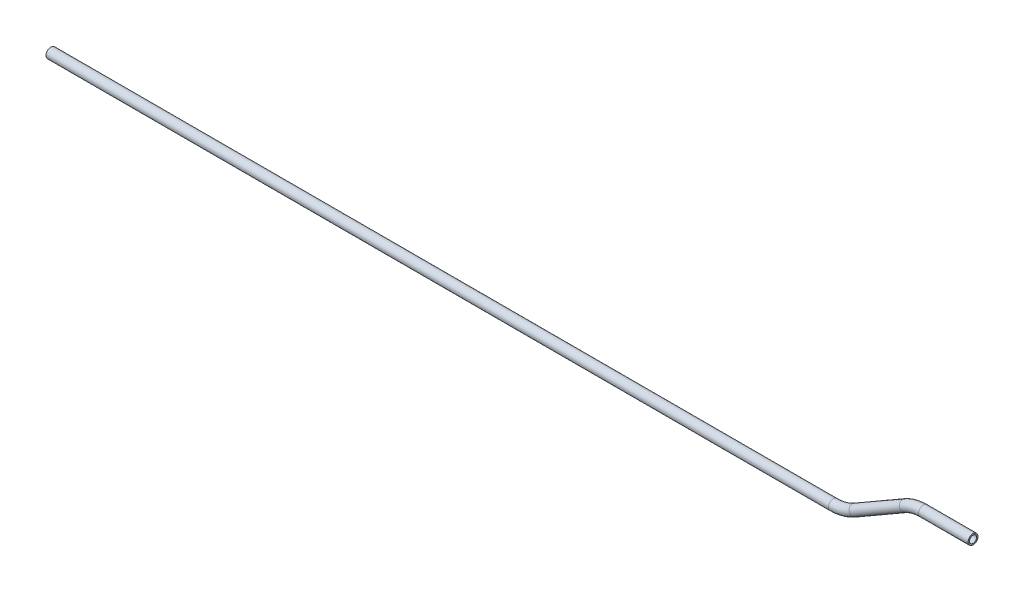
ISO-10303-21;
HEADER;
FILE_DESCRIPTION(('STEP AP214'),'2;1');
FILE_NAME('part.step','',(''),(''),'','','');
FILE_SCHEMA(('AUTOMOTIVE_DESIGN { 1 0 10303 214 1 1 1 1 }'));
ENDSEC;
DATA;
#1=APPLICATION_CONTEXT('core data for automotive mechanical design processes');
#2=APPLICATION_PROTOCOL_DEFINITION('international standard','automotive_design',2000,#1);
#3=PRODUCT_CONTEXT('',#1,'mechanical');
#4=PRODUCT('Part','Part','',(#3));
#5=PRODUCT_RELATED_PRODUCT_CATEGORY('part','',(#4));
#6=PRODUCT_DEFINITION_FORMATION('','',#4);
#7=PRODUCT_DEFINITION_CONTEXT('part definition',#1,'design');
#8=PRODUCT_DEFINITION('design','',#6,#7);
#9=PRODUCT_DEFINITION_SHAPE('','',#8);
#10=(LENGTH_UNIT() NAMED_UNIT(*) SI_UNIT(.MILLI.,.METRE.));
#11=(NAMED_UNIT(*) PLANE_ANGLE_UNIT() SI_UNIT($,.RADIAN.));
#12=(NAMED_UNIT(*) SI_UNIT($,.STERADIAN.) SOLID_ANGLE_UNIT());
#13=UNCERTAINTY_MEASURE_WITH_UNIT(LENGTH_MEASURE(1.E-05),#10,'distance_accuracy_value','');
#14=(GEOMETRIC_REPRESENTATION_CONTEXT(3) GLOBAL_UNCERTAINTY_ASSIGNED_CONTEXT((#13)) GLOBAL_UNIT_ASSIGNED_CONTEXT((#10,
#11,#12)) REPRESENTATION_CONTEXT('',''));
#15=CARTESIAN_POINT('',(0.,0.,0.));
#16=DIRECTION('',(0.,0.,1.));
#17=DIRECTION('',(1.,0.,0.));
#18=AXIS2_PLACEMENT_3D('',#15,#16,#17);
#19=CARTESIAN_POINT('',(-558.334087778049,-25.4000000000037,0.));
#20=DIRECTION('',(1.,0.,0.));
#21=DIRECTION('',(0.,1.,0.));
#22=AXIS2_PLACEMENT_3D('',#19,#20,#21);
#23=CYLINDRICAL_SURFACE('',#22,3.175);
#24=CARTESIAN_POINT('',(-57.672010970273,-25.4000000000001,0.));
#25=DIRECTION('',(1.,0.,0.));
#26=DIRECTION('',(0.,1.,0.));
#27=AXIS2_PLACEMENT_3D('',#24,#25,#26);
#28=CIRCLE('',#27,3.175);
#29=CARTESIAN_POINT('',(-57.672010970273,-28.5749999999999,0.));
#30=VERTEX_POINT('',#29);
#31=EDGE_CURVE('E65',#30,#30,#28,.T.);
#32=ORIENTED_EDGE('',*,*,#31,.F.);
#33=EDGE_LOOP('',(#32));
#34=FACE_BOUND('',#33,.T.);
#35=CARTESIAN_POINT('',(-558.334087778049,-25.4000000000037,0.));
#36=DIRECTION('',(1.,0.,0.));
#37=DIRECTION('',(0.,1.,0.));
#38=AXIS2_PLACEMENT_3D('',#35,#36,#37);
#39=CIRCLE('',#38,3.175);
#40=CARTESIAN_POINT('',(-558.334087778049,-22.2250000000037,0.));
#41=VERTEX_POINT('',#40);
#42=EDGE_CURVE('E61',#41,#41,#39,.T.);
#43=ORIENTED_EDGE('',*,*,#42,.T.);
#44=EDGE_LOOP('',(#43));
#45=FACE_BOUND('',#44,.T.);
#46=ADVANCED_FACE('F37',(#34,#45),#23,.T.);
#47=CARTESIAN_POINT('',(-57.672010970273,1.98550217542068,0.));
#48=DIRECTION('',(0.,0.,1.));
#49=DIRECTION('',(1.,0.,0.));
#50=AXIS2_PLACEMENT_3D('',#47,#48,#49);
#51=TOROIDAL_SURFACE('',#50,27.3855021754206,3.175);
#52=CARTESIAN_POINT('',(-43.9792598825628,-21.7310384038876,0.));
#53=DIRECTION('',(0.86602540378444,0.499999999999998,0.));
#54=DIRECTION('',(-0.499999999999998,0.86602540378444,0.));
#55=AXIS2_PLACEMENT_3D('',#52,#53,#54);
#56=CIRCLE('',#55,3.175);
#57=CARTESIAN_POINT('',(-42.3917598825628,-24.4806690609032,0.));
#58=VERTEX_POINT('',#57);
#59=EDGE_CURVE('E69',#58,#58,#56,.T.);
#60=CARTESIAN_POINT('',(-57.672010970273,1.98550217542068,0.));
#61=DIRECTION('',(0.,0.,1.));
#62=DIRECTION('',(1.,0.,0.));
#63=AXIS2_PLACEMENT_3D('',#60,#61,#62);
#64=CIRCLE('',#63,30.5605021754206);
#65=EDGE_CURVE('',#30,#58,#64,.T.);
#66=ORIENTED_EDGE('',*,*,#31,.T.);
#67=ORIENTED_EDGE('',*,*,#59,.F.);
#68=ORIENTED_EDGE('',*,*,#65,.T.);
#69=ORIENTED_EDGE('',*,*,#65,.F.);
#70=EDGE_LOOP('',(#66,#68,#67,#69));
#71=FACE_BOUND('',#70,.T.);
#72=ADVANCED_FACE('F91',(#71),#51,.T.);
#73=CARTESIAN_POINT('',(-43.9792598825628,-21.7310384038875,0.));
#74=DIRECTION('',(0.866025403784437,0.500000000000003,0.));
#75=DIRECTION('',(-0.500000000000003,0.866025403784437,0.));
#76=AXIS2_PLACEMENT_3D('',#73,#74,#75);
#77=CYLINDRICAL_SURFACE('',#76,3.175);
#78=CARTESIAN_POINT('',(-11.8305959579056,-3.16999863289972,0.));
#79=DIRECTION('',(0.866025403784437,0.500000000000003,0.));
#80=DIRECTION('',(-0.500000000000003,0.866025403784437,0.));
#81=AXIS2_PLACEMENT_3D('',#78,#79,#80);
#82=CIRCLE('',#81,3.175);
#83=CARTESIAN_POINT('',(-13.4180959579056,-0.420367975884135,0.));
#84=VERTEX_POINT('',#83);
#85=EDGE_CURVE('E72',#84,#84,#82,.T.);
#86=ORIENTED_EDGE('',*,*,#85,.F.);
#87=EDGE_LOOP('',(#86));
#88=FACE_BOUND('',#87,.T.);
#89=ORIENTED_EDGE('',*,*,#59,.T.);
#90=EDGE_LOOP('',(#89));
#91=FACE_BOUND('',#90,.T.);
#92=ADVANCED_FACE('F84',(#88,#91),#77,.T.);
#93=CARTESIAN_POINT('',(0.,-23.661191915811,0.));
#94=DIRECTION('',(0.,0.,-1.));
#95=DIRECTION('',(-1.,0.,0.));
#96=AXIS2_PLACEMENT_3D('',#93,#94,#95);
#97=TOROIDAL_SURFACE('',#96,23.661191915811,3.175);
#98=CARTESIAN_POINT('',(0.,0.,0.));
#99=DIRECTION('',(1.,0.,0.));
#100=DIRECTION('',(0.,1.,0.));
#101=AXIS2_PLACEMENT_3D('',#98,#99,#100);
#102=CIRCLE('',#101,3.175);
#103=CARTESIAN_POINT('',(0.,3.175,0.));
#104=VERTEX_POINT('',#103);
#105=EDGE_CURVE('E41',#104,#104,#102,.T.);
#106=CARTESIAN_POINT('',(0.,-23.661191915811,0.));
#107=DIRECTION('',(0.,0.,-1.));
#108=DIRECTION('',(-1.,0.,0.));
#109=AXIS2_PLACEMENT_3D('',#106,#107,#108);
#110=CIRCLE('',#109,26.836191915811);
#111=EDGE_CURVE('',#84,#104,#110,.T.);
#112=ORIENTED_EDGE('',*,*,#85,.T.);
#113=ORIENTED_EDGE('',*,*,#105,.F.);
#114=ORIENTED_EDGE('',*,*,#111,.T.);
#115=ORIENTED_EDGE('',*,*,#111,.F.);
#116=EDGE_LOOP('',(#112,#114,#113,#115));
#117=FACE_BOUND('',#116,.T.);
#118=ADVANCED_FACE('F82',(#117),#97,.T.);
#119=CARTESIAN_POINT('',(0.,0.,0.));
#120=DIRECTION('',(1.,0.,0.));
#121=DIRECTION('',(0.,1.,0.));
#122=AXIS2_PLACEMENT_3D('',#119,#120,#121);
#123=CYLINDRICAL_SURFACE('',#122,3.175);
#124=CARTESIAN_POINT('',(31.7600027342006,0.,0.));
#125=DIRECTION('',(1.,0.,0.));
#126=DIRECTION('',(0.,1.,0.));
#127=AXIS2_PLACEMENT_3D('',#124,#125,#126);
#128=CIRCLE('',#127,3.175);
#129=CARTESIAN_POINT('',(31.7600027342006,3.175,0.));
#130=VERTEX_POINT('',#129);
#131=EDGE_CURVE('E56',#130,#130,#128,.T.);
#132=ORIENTED_EDGE('',*,*,#131,.F.);
#133=EDGE_LOOP('',(#132));
#134=FACE_BOUND('',#133,.T.);
#135=ORIENTED_EDGE('',*,*,#105,.T.);
#136=EDGE_LOOP('',(#135));
#137=FACE_BOUND('',#136,.T.);
#138=ADVANCED_FACE('F39',(#134,#137),#123,.T.);
#139=CARTESIAN_POINT('',(-558.334087778049,-25.4000000000037,0.));
#140=DIRECTION('',(1.,0.,0.));
#141=DIRECTION('',(0.,1.,0.));
#142=AXIS2_PLACEMENT_3D('',#139,#140,#141);
#143=PLANE('',#142);
#144=CARTESIAN_POINT('',(-558.334087778049,-25.4000000000037,0.));
#145=DIRECTION('',(1.,0.,0.));
#146=DIRECTION('',(0.,1.,0.));
#147=AXIS2_PLACEMENT_3D('',#144,#145,#146);
#148=CIRCLE('',#147,2.286);
#149=CARTESIAN_POINT('',(-558.334087778049,-23.1140000000037,0.));
#150=VERTEX_POINT('',#149);
#151=EDGE_CURVE('E60',#150,#150,#148,.F.);
#152=ORIENTED_EDGE('',*,*,#151,.F.);
#153=EDGE_LOOP('',(#152));
#154=FACE_BOUND('',#153,.T.);
#155=ORIENTED_EDGE('',*,*,#42,.F.);
#156=EDGE_LOOP('',(#155));
#157=FACE_BOUND('',#156,.T.);
#158=ADVANCED_FACE('F89',(#154,#157),#143,.F.);
#159=CARTESIAN_POINT('',(31.7600027342006,0.,0.));
#160=DIRECTION('',(1.,0.,0.));
#161=DIRECTION('',(0.,1.,0.));
#162=AXIS2_PLACEMENT_3D('',#159,#160,#161);
#163=PLANE('',#162);
#164=CARTESIAN_POINT('',(31.7600027342006,0.,0.));
#165=DIRECTION('',(1.,0.,0.));
#166=DIRECTION('',(0.,1.,0.));
#167=AXIS2_PLACEMENT_3D('',#164,#165,#166);
#168=CIRCLE('',#167,2.286);
#169=CARTESIAN_POINT('',(31.7600027342006,2.286,0.));
#170=VERTEX_POINT('',#169);
#171=EDGE_CURVE('E10',#170,#170,#168,.F.);
#172=ORIENTED_EDGE('',*,*,#171,.T.);
#173=EDGE_LOOP('',(#172));
#174=FACE_BOUND('',#173,.T.);
#175=ORIENTED_EDGE('',*,*,#131,.T.);
#176=EDGE_LOOP('',(#175));
#177=FACE_BOUND('',#176,.T.);
#178=ADVANCED_FACE('F108',(#174,#177),#163,.T.);
#179=CARTESIAN_POINT('',(-558.334087778049,-25.4000000000037,0.));
#180=DIRECTION('',(1.,0.,0.));
#181=DIRECTION('',(0.,1.,0.));
#182=AXIS2_PLACEMENT_3D('',#179,#180,#181);
#183=CYLINDRICAL_SURFACE('',#182,2.286);
#184=CARTESIAN_POINT('',(-57.672010970273,-25.4000000000001,0.));
#185=DIRECTION('',(1.,0.,0.));
#186=DIRECTION('',(0.,1.,0.));
#187=AXIS2_PLACEMENT_3D('',#184,#185,#186);
#188=CIRCLE('',#187,2.286);
#189=CARTESIAN_POINT('',(-57.672010970273,-27.6859999999999,0.));
#190=VERTEX_POINT('',#189);
#191=EDGE_CURVE('E205',#190,#190,#188,.F.);
#192=ORIENTED_EDGE('',*,*,#191,.F.);
#193=EDGE_LOOP('',(#192));
#194=FACE_BOUND('',#193,.T.);
#195=ORIENTED_EDGE('',*,*,#151,.T.);
#196=EDGE_LOOP('',(#195));
#197=FACE_BOUND('',#196,.T.);
#198=ADVANCED_FACE('F111',(#194,#197),#183,.F.);
#199=CARTESIAN_POINT('',(-57.672010970273,1.98550217542068,0.));
#200=DIRECTION('',(0.,0.,1.));
#201=DIRECTION('',(1.,0.,0.));
#202=AXIS2_PLACEMENT_3D('',#199,#200,#201);
#203=TOROIDAL_SURFACE('',#202,27.3855021754206,2.286);
#204=CARTESIAN_POINT('',(-43.9792598825628,-21.7310384038876,0.));
#205=DIRECTION('',(0.86602540378444,0.499999999999998,0.));
#206=DIRECTION('',(-0.499999999999998,0.86602540378444,0.));
#207=AXIS2_PLACEMENT_3D('',#204,#205,#206);
#208=CIRCLE('',#207,2.286);
#209=CARTESIAN_POINT('',(-42.8362598825628,-23.7107724769388,0.));
#210=VERTEX_POINT('',#209);
#211=EDGE_CURVE('E203',#210,#210,#208,.F.);
#212=CARTESIAN_POINT('',(-57.672010970273,1.98550217542068,0.));
#213=DIRECTION('',(0.,0.,1.));
#214=DIRECTION('',(1.,0.,0.));
#215=AXIS2_PLACEMENT_3D('',#212,#213,#214);
#216=CIRCLE('',#215,29.6715021754206);
#217=EDGE_CURVE('',#190,#210,#216,.T.);
#218=ORIENTED_EDGE('',*,*,#191,.T.);
#219=ORIENTED_EDGE('',*,*,#211,.F.);
#220=ORIENTED_EDGE('',*,*,#217,.T.);
#221=ORIENTED_EDGE('',*,*,#217,.F.);
#222=EDGE_LOOP('',(#218,#220,#219,#221));
#223=FACE_BOUND('',#222,.T.);
#224=ADVANCED_FACE('F166',(#223),#203,.F.);
#225=CARTESIAN_POINT('',(-43.9792598825628,-21.7310384038875,0.));
#226=DIRECTION('',(0.866025403784437,0.500000000000003,0.));
#227=DIRECTION('',(-0.500000000000003,0.866025403784437,0.));
#228=AXIS2_PLACEMENT_3D('',#225,#226,#227);
#229=CYLINDRICAL_SURFACE('',#228,2.286);
#230=CARTESIAN_POINT('',(-11.8305959579056,-3.16999863289972,0.));
#231=DIRECTION('',(0.866025403784437,0.500000000000003,0.));
#232=DIRECTION('',(-0.500000000000003,0.866025403784437,0.));
#233=AXIS2_PLACEMENT_3D('',#230,#231,#232);
#234=CIRCLE('',#233,2.286);
#235=CARTESIAN_POINT('',(-12.9735959579056,-1.1902645598485,0.));
#236=VERTEX_POINT('',#235);
#237=EDGE_CURVE('E52',#236,#236,#234,.F.);
#238=ORIENTED_EDGE('',*,*,#237,.F.);
#239=EDGE_LOOP('',(#238));
#240=FACE_BOUND('',#239,.T.);
#241=ORIENTED_EDGE('',*,*,#211,.T.);
#242=EDGE_LOOP('',(#241));
#243=FACE_BOUND('',#242,.T.);
#244=ADVANCED_FACE('F102',(#240,#243),#229,.F.);
#245=CARTESIAN_POINT('',(0.,-23.661191915811,0.));
#246=DIRECTION('',(0.,0.,-1.));
#247=DIRECTION('',(-1.,0.,0.));
#248=AXIS2_PLACEMENT_3D('',#245,#246,#247);
#249=TOROIDAL_SURFACE('',#248,23.661191915811,2.286);
#250=CARTESIAN_POINT('',(0.,0.,0.));
#251=DIRECTION('',(1.,0.,0.));
#252=DIRECTION('',(0.,1.,0.));
#253=AXIS2_PLACEMENT_3D('',#250,#251,#252);
#254=CIRCLE('',#253,2.286);
#255=CARTESIAN_POINT('',(0.,2.286,0.));
#256=VERTEX_POINT('',#255);
#257=EDGE_CURVE('E46',#256,#256,#254,.F.);
#258=CARTESIAN_POINT('',(0.,-23.661191915811,0.));
#259=DIRECTION('',(0.,0.,-1.));
#260=DIRECTION('',(-1.,0.,0.));
#261=AXIS2_PLACEMENT_3D('',#258,#259,#260);
#262=CIRCLE('',#261,25.947191915811);
#263=EDGE_CURVE('',#236,#256,#262,.T.);
#264=ORIENTED_EDGE('',*,*,#237,.T.);
#265=ORIENTED_EDGE('',*,*,#257,.F.);
#266=ORIENTED_EDGE('',*,*,#263,.T.);
#267=ORIENTED_EDGE('',*,*,#263,.F.);
#268=EDGE_LOOP('',(#264,#266,#265,#267));
#269=FACE_BOUND('',#268,.T.);
#270=ADVANCED_FACE('F96',(#269),#249,.F.);
#271=CARTESIAN_POINT('',(0.,0.,0.));
#272=DIRECTION('',(1.,0.,0.));
#273=DIRECTION('',(0.,1.,0.));
#274=AXIS2_PLACEMENT_3D('',#271,#272,#273);
#275=CYLINDRICAL_SURFACE('',#274,2.286);
#276=ORIENTED_EDGE('',*,*,#171,.F.);
#277=EDGE_LOOP('',(#276));
#278=FACE_BOUND('',#277,.T.);
#279=ORIENTED_EDGE('',*,*,#257,.T.);
#280=EDGE_LOOP('',(#279));
#281=FACE_BOUND('',#280,.T.);
#282=ADVANCED_FACE('F94',(#278,#281),#275,.F.);
#283=CLOSED_SHELL('',(#46,#72,#92,#118,#138,#158,#178,#198,#224,#244,#270,#282));
#284=MANIFOLD_SOLID_BREP('B2',#283);
#285=ADVANCED_BREP_SHAPE_REPRESENTATION('',(#18,#284),#14);
#286=SHAPE_DEFINITION_REPRESENTATION(#9,#285);
ENDSEC;
END-ISO-10303-21;
